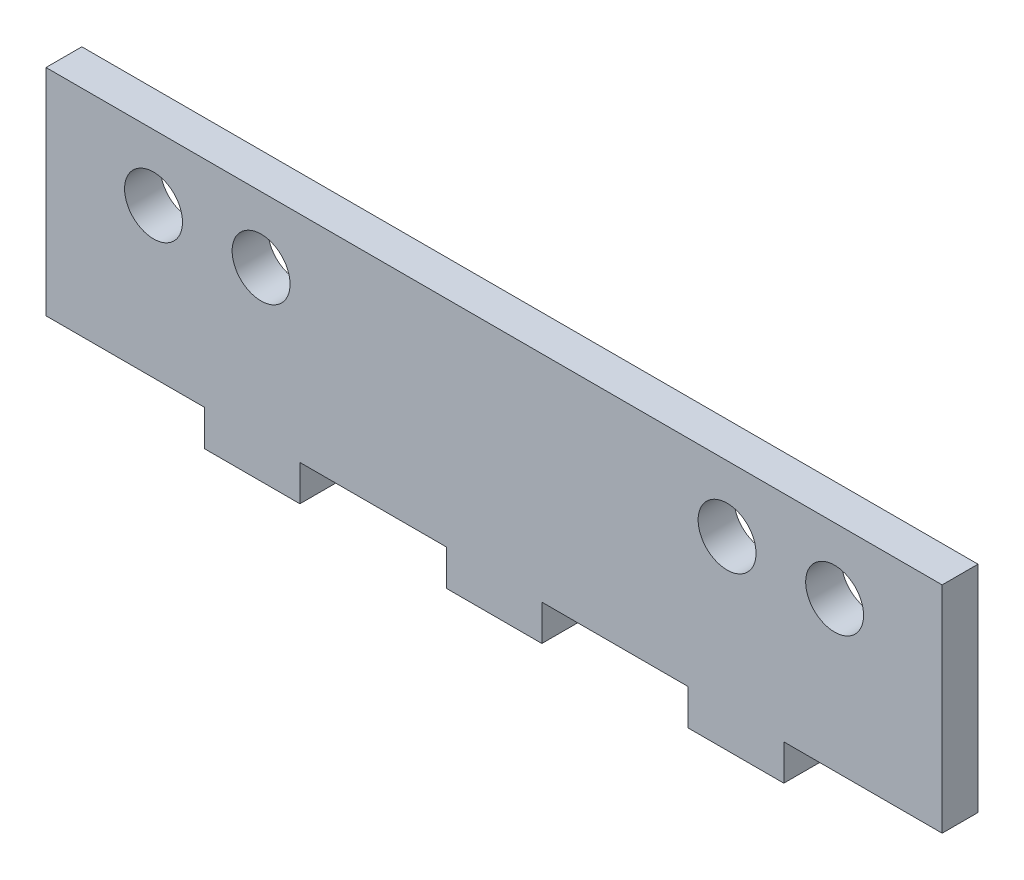
ISO-10303-21;
HEADER;
FILE_DESCRIPTION(('STEP AP214'),'2;1');
FILE_NAME('part.step','',(''),(''),'','','');
FILE_SCHEMA(('AUTOMOTIVE_DESIGN { 1 0 10303 214 1 1 1 1 }'));
ENDSEC;
DATA;
#1=APPLICATION_CONTEXT('core data for automotive mechanical design processes');
#2=APPLICATION_PROTOCOL_DEFINITION('international standard','automotive_design',2000,#1);
#3=PRODUCT_CONTEXT('',#1,'mechanical');
#4=PRODUCT('Part','Part','',(#3));
#5=PRODUCT_RELATED_PRODUCT_CATEGORY('part','',(#4));
#6=PRODUCT_DEFINITION_FORMATION('','',#4);
#7=PRODUCT_DEFINITION_CONTEXT('part definition',#1,'design');
#8=PRODUCT_DEFINITION('design','',#6,#7);
#9=PRODUCT_DEFINITION_SHAPE('','',#8);
#10=(LENGTH_UNIT() NAMED_UNIT(*) SI_UNIT(.MILLI.,.METRE.));
#11=(NAMED_UNIT(*) PLANE_ANGLE_UNIT() SI_UNIT($,.RADIAN.));
#12=(NAMED_UNIT(*) SI_UNIT($,.STERADIAN.) SOLID_ANGLE_UNIT());
#13=UNCERTAINTY_MEASURE_WITH_UNIT(LENGTH_MEASURE(1.E-05),#10,'distance_accuracy_value','');
#14=(GEOMETRIC_REPRESENTATION_CONTEXT(3) GLOBAL_UNCERTAINTY_ASSIGNED_CONTEXT((#13)) GLOBAL_UNIT_ASSIGNED_CONTEXT((#10,
#11,#12)) REPRESENTATION_CONTEXT('',''));
#15=CARTESIAN_POINT('',(0.,0.,0.));
#16=DIRECTION('',(0.,0.,1.));
#17=DIRECTION('',(1.,0.,0.));
#18=AXIS2_PLACEMENT_3D('',#15,#16,#17);
#19=CARTESIAN_POINT('',(37.5,-8.99999999999999,3.));
#20=DIRECTION('',(0.,1.,0.));
#21=DIRECTION('',(-1.,0.,0.));
#22=AXIS2_PLACEMENT_3D('',#19,#20,#21);
#23=PLANE('',#22);
#24=DIRECTION('',(0.,0.,1.));
#25=VECTOR('',#24,1.);
#26=CARTESIAN_POINT('',(-16.25,-9.,0.));
#27=LINE('',#26,#25);
#28=CARTESIAN_POINT('',(-16.25,-9.,0.));
#29=VERTEX_POINT('',#28);
#30=CARTESIAN_POINT('',(-16.25,-9.,3.));
#31=VERTEX_POINT('',#30);
#32=EDGE_CURVE('E169',#29,#31,#27,.T.);
#33=ORIENTED_EDGE('',*,*,#32,.F.);
#34=DIRECTION('',(1.,0.,0.));
#35=VECTOR('',#34,1.);
#36=CARTESIAN_POINT('',(37.5,-8.99999999999999,0.));
#37=LINE('',#36,#35);
#38=CARTESIAN_POINT('',(-3.99999999999999,-9.,0.));
#39=VERTEX_POINT('',#38);
#40=EDGE_CURVE('E247',#29,#39,#37,.T.);
#41=ORIENTED_EDGE('',*,*,#40,.T.);
#42=DIRECTION('',(0.,0.,-1.));
#43=VECTOR('',#42,1.);
#44=CARTESIAN_POINT('',(-3.99999999999999,-9.,0.));
#45=LINE('',#44,#43);
#46=CARTESIAN_POINT('',(-3.99999999999999,-9.,3.));
#47=VERTEX_POINT('',#46);
#48=EDGE_CURVE('E173',#47,#39,#45,.T.);
#49=ORIENTED_EDGE('',*,*,#48,.F.);
#50=DIRECTION('',(1.,0.,0.));
#51=VECTOR('',#50,1.);
#52=CARTESIAN_POINT('',(37.5,-8.99999999999999,3.));
#53=LINE('',#52,#51);
#54=EDGE_CURVE('E48',#31,#47,#53,.T.);
#55=ORIENTED_EDGE('',*,*,#54,.F.);
#56=EDGE_LOOP('',(#33,#41,#49,#55));
#57=FACE_BOUND('',#56,.T.);
#58=ADVANCED_FACE('F33',(#57),#23,.F.);
#59=DIRECTION('',(0.,0.,-1.));
#60=VECTOR('',#59,1.);
#61=CARTESIAN_POINT('',(-24.25,-9.,0.));
#62=LINE('',#61,#60);
#63=CARTESIAN_POINT('',(-24.25,-9.,3.));
#64=VERTEX_POINT('',#63);
#65=CARTESIAN_POINT('',(-24.25,-9.,0.));
#66=VERTEX_POINT('',#65);
#67=EDGE_CURVE('E56',#64,#66,#62,.T.);
#68=ORIENTED_EDGE('',*,*,#67,.F.);
#69=CARTESIAN_POINT('',(-37.5,-9.,3.));
#70=VERTEX_POINT('',#69);
#71=EDGE_CURVE('E234',#70,#64,#53,.T.);
#72=ORIENTED_EDGE('',*,*,#71,.F.);
#73=DIRECTION('',(0.,0.,-1.));
#74=VECTOR('',#73,1.);
#75=CARTESIAN_POINT('',(-37.5,-9.,3.));
#76=LINE('',#75,#74);
#77=CARTESIAN_POINT('',(-37.5,-9.,0.));
#78=VERTEX_POINT('',#77);
#79=EDGE_CURVE('E11',#70,#78,#76,.T.);
#80=ORIENTED_EDGE('',*,*,#79,.T.);
#81=EDGE_CURVE('E244',#78,#66,#37,.T.);
#82=ORIENTED_EDGE('',*,*,#81,.T.);
#83=EDGE_LOOP('',(#68,#72,#80,#82));
#84=FACE_BOUND('',#83,.T.);
#85=ADVANCED_FACE('F312',(#84),#23,.F.);
#86=DIRECTION('',(0.,0.,1.));
#87=VECTOR('',#86,1.);
#88=CARTESIAN_POINT('',(4.00000000000001,-9.,0.));
#89=LINE('',#88,#87);
#90=CARTESIAN_POINT('',(4.00000000000001,-9.,0.));
#91=VERTEX_POINT('',#90);
#92=CARTESIAN_POINT('',(4.00000000000002,-9.,3.));
#93=VERTEX_POINT('',#92);
#94=EDGE_CURVE('E170',#91,#93,#89,.T.);
#95=ORIENTED_EDGE('',*,*,#94,.F.);
#96=CARTESIAN_POINT('',(16.25,-8.99999999999999,0.));
#97=VERTEX_POINT('',#96);
#98=EDGE_CURVE('E295',#91,#97,#37,.T.);
#99=ORIENTED_EDGE('',*,*,#98,.T.);
#100=DIRECTION('',(0.,0.,-1.));
#101=VECTOR('',#100,1.);
#102=CARTESIAN_POINT('',(16.25,-8.99999999999999,0.));
#103=LINE('',#102,#101);
#104=CARTESIAN_POINT('',(16.25,-8.99999999999999,3.));
#105=VERTEX_POINT('',#104);
#106=EDGE_CURVE('E207',#105,#97,#103,.T.);
#107=ORIENTED_EDGE('',*,*,#106,.F.);
#108=EDGE_CURVE('E276',#93,#105,#53,.T.);
#109=ORIENTED_EDGE('',*,*,#108,.F.);
#110=EDGE_LOOP('',(#95,#99,#107,#109));
#111=FACE_BOUND('',#110,.T.);
#112=ADVANCED_FACE('F294',(#111),#23,.F.);
#113=DIRECTION('',(0.,0.,1.));
#114=VECTOR('',#113,1.);
#115=CARTESIAN_POINT('',(24.25,-8.99999999999999,0.));
#116=LINE('',#115,#114);
#117=CARTESIAN_POINT('',(24.25,-8.99999999999999,0.));
#118=VERTEX_POINT('',#117);
#119=CARTESIAN_POINT('',(24.25,-8.99999999999999,3.));
#120=VERTEX_POINT('',#119);
#121=EDGE_CURVE('E202',#118,#120,#116,.T.);
#122=ORIENTED_EDGE('',*,*,#121,.F.);
#123=CARTESIAN_POINT('',(37.5,-8.99999999999999,0.));
#124=VERTEX_POINT('',#123);
#125=EDGE_CURVE('E243',#118,#124,#37,.T.);
#126=ORIENTED_EDGE('',*,*,#125,.T.);
#127=DIRECTION('',(0.,0.,-1.));
#128=VECTOR('',#127,1.);
#129=CARTESIAN_POINT('',(37.5,-8.99999999999999,3.));
#130=LINE('',#129,#128);
#131=CARTESIAN_POINT('',(37.5,-8.99999999999999,3.));
#132=VERTEX_POINT('',#131);
#133=EDGE_CURVE('E41',#132,#124,#130,.T.);
#134=ORIENTED_EDGE('',*,*,#133,.F.);
#135=EDGE_CURVE('E232',#120,#132,#53,.T.);
#136=ORIENTED_EDGE('',*,*,#135,.F.);
#137=EDGE_LOOP('',(#122,#126,#134,#136));
#138=FACE_BOUND('',#137,.T.);
#139=ADVANCED_FACE('F306',(#138),#23,.F.);
#140=CARTESIAN_POINT('',(-37.5,9.,3.));
#141=DIRECTION('',(1.,0.,0.));
#142=DIRECTION('',(0.,0.,-1.));
#143=AXIS2_PLACEMENT_3D('',#140,#141,#142);
#144=PLANE('',#143);
#145=DIRECTION('',(0.,-1.,0.));
#146=VECTOR('',#145,1.);
#147=CARTESIAN_POINT('',(-37.5,9.,0.));
#148=LINE('',#147,#146);
#149=CARTESIAN_POINT('',(-37.5,9.,0.));
#150=VERTEX_POINT('',#149);
#151=EDGE_CURVE('E229',#150,#78,#148,.T.);
#152=ORIENTED_EDGE('',*,*,#151,.T.);
#153=ORIENTED_EDGE('',*,*,#79,.F.);
#154=DIRECTION('',(0.,-1.,0.));
#155=VECTOR('',#154,1.);
#156=CARTESIAN_POINT('',(-37.5,9.,3.));
#157=LINE('',#156,#155);
#158=CARTESIAN_POINT('',(-37.5,9.,3.));
#159=VERTEX_POINT('',#158);
#160=EDGE_CURVE('E230',#159,#70,#157,.T.);
#161=ORIENTED_EDGE('',*,*,#160,.F.);
#162=DIRECTION('',(0.,0.,-1.));
#163=VECTOR('',#162,1.);
#164=CARTESIAN_POINT('',(-37.5,9.,3.));
#165=LINE('',#164,#163);
#166=EDGE_CURVE('E240',#159,#150,#165,.T.);
#167=ORIENTED_EDGE('',*,*,#166,.T.);
#168=EDGE_LOOP('',(#152,#153,#161,#167));
#169=FACE_BOUND('',#168,.T.);
#170=ADVANCED_FACE('F35',(#169),#144,.F.);
#171=CARTESIAN_POINT('',(37.5,9.00000000000001,3.));
#172=DIRECTION('',(-1.,0.,0.));
#173=DIRECTION('',(0.,0.,1.));
#174=AXIS2_PLACEMENT_3D('',#171,#172,#173);
#175=PLANE('',#174);
#176=DIRECTION('',(0.,1.,0.));
#177=VECTOR('',#176,1.);
#178=CARTESIAN_POINT('',(37.5,9.00000000000001,0.));
#179=LINE('',#178,#177);
#180=CARTESIAN_POINT('',(37.5,9.00000000000001,0.));
#181=VERTEX_POINT('',#180);
#182=EDGE_CURVE('E246',#124,#181,#179,.T.);
#183=ORIENTED_EDGE('',*,*,#182,.T.);
#184=DIRECTION('',(0.,0.,-1.));
#185=VECTOR('',#184,1.);
#186=CARTESIAN_POINT('',(37.5,9.00000000000001,3.));
#187=LINE('',#186,#185);
#188=CARTESIAN_POINT('',(37.5,9.00000000000001,3.));
#189=VERTEX_POINT('',#188);
#190=EDGE_CURVE('E252',#189,#181,#187,.T.);
#191=ORIENTED_EDGE('',*,*,#190,.F.);
#192=DIRECTION('',(0.,1.,0.));
#193=VECTOR('',#192,1.);
#194=CARTESIAN_POINT('',(37.5,9.00000000000001,3.));
#195=LINE('',#194,#193);
#196=EDGE_CURVE('E236',#132,#189,#195,.T.);
#197=ORIENTED_EDGE('',*,*,#196,.F.);
#198=ORIENTED_EDGE('',*,*,#133,.T.);
#199=EDGE_LOOP('',(#183,#191,#197,#198));
#200=FACE_BOUND('',#199,.T.);
#201=ADVANCED_FACE('F259',(#200),#175,.F.);
#202=CARTESIAN_POINT('',(37.5,9.00000000000001,3.));
#203=DIRECTION('',(0.,-1.,0.));
#204=DIRECTION('',(1.,0.,0.));
#205=AXIS2_PLACEMENT_3D('',#202,#203,#204);
#206=PLANE('',#205);
#207=DIRECTION('',(-1.,0.,0.));
#208=VECTOR('',#207,1.);
#209=CARTESIAN_POINT('',(37.5,9.00000000000001,0.));
#210=LINE('',#209,#208);
#211=EDGE_CURVE('E233',#181,#150,#210,.T.);
#212=ORIENTED_EDGE('',*,*,#211,.T.);
#213=ORIENTED_EDGE('',*,*,#166,.F.);
#214=DIRECTION('',(-1.,0.,0.));
#215=VECTOR('',#214,1.);
#216=CARTESIAN_POINT('',(37.5,9.00000000000001,3.));
#217=LINE('',#216,#215);
#218=EDGE_CURVE('E238',#189,#159,#217,.T.);
#219=ORIENTED_EDGE('',*,*,#218,.F.);
#220=ORIENTED_EDGE('',*,*,#190,.T.);
#221=EDGE_LOOP('',(#212,#213,#219,#220));
#222=FACE_BOUND('',#221,.T.);
#223=ADVANCED_FACE('F270',(#222),#206,.F.);
#224=CARTESIAN_POINT('',(0.,0.,3.));
#225=DIRECTION('',(0.,0.,-1.));
#226=DIRECTION('',(-1.,0.,0.));
#227=AXIS2_PLACEMENT_3D('',#224,#225,#226);
#228=PLANE('',#227);
#229=CARTESIAN_POINT('',(28.5,3.50000000000001,3.));
#230=DIRECTION('',(0.,0.,-1.));
#231=DIRECTION('',(-1.,0.,0.));
#232=AXIS2_PLACEMENT_3D('',#229,#230,#231);
#233=CIRCLE('',#232,2.425);
#234=CARTESIAN_POINT('',(26.075,3.50000000000001,3.));
#235=VERTEX_POINT('',#234);
#236=EDGE_CURVE('E512',#235,#235,#233,.T.);
#237=ORIENTED_EDGE('',*,*,#236,.T.);
#238=EDGE_LOOP('',(#237));
#239=FACE_BOUND('',#238,.T.);
#240=CARTESIAN_POINT('',(-19.5,3.50000000000001,3.));
#241=DIRECTION('',(0.,0.,-1.));
#242=DIRECTION('',(-1.,0.,0.));
#243=AXIS2_PLACEMENT_3D('',#240,#241,#242);
#244=CIRCLE('',#243,2.425);
#245=CARTESIAN_POINT('',(-21.925,3.50000000000001,3.));
#246=VERTEX_POINT('',#245);
#247=EDGE_CURVE('E523',#246,#246,#244,.T.);
#248=ORIENTED_EDGE('',*,*,#247,.T.);
#249=EDGE_LOOP('',(#248));
#250=FACE_BOUND('',#249,.T.);
#251=CARTESIAN_POINT('',(19.5,3.50000000000001,3.));
#252=DIRECTION('',(0.,0.,-1.));
#253=DIRECTION('',(-1.,0.,0.));
#254=AXIS2_PLACEMENT_3D('',#251,#252,#253);
#255=CIRCLE('',#254,2.425);
#256=CARTESIAN_POINT('',(17.075,3.50000000000001,3.));
#257=VERTEX_POINT('',#256);
#258=EDGE_CURVE('E532',#257,#257,#255,.T.);
#259=ORIENTED_EDGE('',*,*,#258,.T.);
#260=EDGE_LOOP('',(#259));
#261=FACE_BOUND('',#260,.T.);
#262=CARTESIAN_POINT('',(-28.5,3.50000000000001,3.));
#263=DIRECTION('',(0.,0.,-1.));
#264=DIRECTION('',(-1.,0.,0.));
#265=AXIS2_PLACEMENT_3D('',#262,#263,#264);
#266=CIRCLE('',#265,2.425);
#267=CARTESIAN_POINT('',(-30.925,3.50000000000001,3.));
#268=VERTEX_POINT('',#267);
#269=EDGE_CURVE('E516',#268,#268,#266,.T.);
#270=ORIENTED_EDGE('',*,*,#269,.T.);
#271=EDGE_LOOP('',(#270));
#272=FACE_BOUND('',#271,.T.);
#273=ORIENTED_EDGE('',*,*,#160,.T.);
#274=ORIENTED_EDGE('',*,*,#71,.T.);
#275=DIRECTION('',(0.,1.,0.));
#276=VECTOR('',#275,1.);
#277=CARTESIAN_POINT('',(-24.25,-12.,3.));
#278=LINE('',#277,#276);
#279=CARTESIAN_POINT('',(-24.25,-12.,3.));
#280=VERTEX_POINT('',#279);
#281=EDGE_CURVE('E154',#280,#64,#278,.T.);
#282=ORIENTED_EDGE('',*,*,#281,.F.);
#283=DIRECTION('',(-1.,0.,0.));
#284=VECTOR('',#283,1.);
#285=CARTESIAN_POINT('',(-16.25,-12.,3.));
#286=LINE('',#285,#284);
#287=CARTESIAN_POINT('',(-16.25,-12.,3.));
#288=VERTEX_POINT('',#287);
#289=EDGE_CURVE('E146',#288,#280,#286,.T.);
#290=ORIENTED_EDGE('',*,*,#289,.F.);
#291=DIRECTION('',(0.,1.,0.));
#292=VECTOR('',#291,1.);
#293=CARTESIAN_POINT('',(-16.25,-12.,3.));
#294=LINE('',#293,#292);
#295=EDGE_CURVE('E151',#288,#31,#294,.T.);
#296=ORIENTED_EDGE('',*,*,#295,.T.);
#297=ORIENTED_EDGE('',*,*,#54,.T.);
#298=DIRECTION('',(0.,1.,0.));
#299=VECTOR('',#298,1.);
#300=CARTESIAN_POINT('',(-3.99999999999999,-12.,3.));
#301=LINE('',#300,#299);
#302=CARTESIAN_POINT('',(-3.99999999999999,-12.,3.));
#303=VERTEX_POINT('',#302);
#304=EDGE_CURVE('E196',#303,#47,#301,.T.);
#305=ORIENTED_EDGE('',*,*,#304,.F.);
#306=DIRECTION('',(-1.,0.,0.));
#307=VECTOR('',#306,1.);
#308=CARTESIAN_POINT('',(4.00000000000002,-12.,3.));
#309=LINE('',#308,#307);
#310=CARTESIAN_POINT('',(4.00000000000002,-12.,3.));
#311=VERTEX_POINT('',#310);
#312=EDGE_CURVE('E182',#311,#303,#309,.T.);
#313=ORIENTED_EDGE('',*,*,#312,.F.);
#314=DIRECTION('',(0.,1.,0.));
#315=VECTOR('',#314,1.);
#316=CARTESIAN_POINT('',(4.00000000000002,-12.,3.));
#317=LINE('',#316,#315);
#318=EDGE_CURVE('E199',#311,#93,#317,.T.);
#319=ORIENTED_EDGE('',*,*,#318,.T.);
#320=ORIENTED_EDGE('',*,*,#108,.T.);
#321=DIRECTION('',(0.,1.,0.));
#322=VECTOR('',#321,1.);
#323=CARTESIAN_POINT('',(16.25,-12.,3.));
#324=LINE('',#323,#322);
#325=CARTESIAN_POINT('',(16.25,-12.,3.));
#326=VERTEX_POINT('',#325);
#327=EDGE_CURVE('E223',#326,#105,#324,.T.);
#328=ORIENTED_EDGE('',*,*,#327,.F.);
#329=DIRECTION('',(-1.,0.,0.));
#330=VECTOR('',#329,1.);
#331=CARTESIAN_POINT('',(24.25,-12.,3.));
#332=LINE('',#331,#330);
#333=CARTESIAN_POINT('',(24.25,-12.,3.));
#334=VERTEX_POINT('',#333);
#335=EDGE_CURVE('E206',#334,#326,#332,.T.);
#336=ORIENTED_EDGE('',*,*,#335,.F.);
#337=DIRECTION('',(0.,1.,0.));
#338=VECTOR('',#337,1.);
#339=CARTESIAN_POINT('',(24.25,-12.,3.));
#340=LINE('',#339,#338);
#341=EDGE_CURVE('E226',#334,#120,#340,.T.);
#342=ORIENTED_EDGE('',*,*,#341,.T.);
#343=ORIENTED_EDGE('',*,*,#135,.T.);
#344=ORIENTED_EDGE('',*,*,#196,.T.);
#345=ORIENTED_EDGE('',*,*,#218,.T.);
#346=EDGE_LOOP('',(#273,#274,#282,#290,#296,#297,#305,#313,#319,#320,#328,#336,#342,#343,#344,#345));
#347=FACE_BOUND('',#346,.T.);
#348=ADVANCED_FACE('F149',(#239,#250,#261,#272,#347),#228,.F.);
#349=CARTESIAN_POINT('',(0.,0.,0.));
#350=DIRECTION('',(0.,0.,-1.));
#351=DIRECTION('',(-1.,0.,0.));
#352=AXIS2_PLACEMENT_3D('',#349,#350,#351);
#353=PLANE('',#352);
#354=CARTESIAN_POINT('',(28.5,3.50000000000001,0.));
#355=DIRECTION('',(0.,0.,-1.));
#356=DIRECTION('',(-1.,0.,0.));
#357=AXIS2_PLACEMENT_3D('',#354,#355,#356);
#358=CIRCLE('',#357,2.425);
#359=CARTESIAN_POINT('',(26.075,3.50000000000001,0.));
#360=VERTEX_POINT('',#359);
#361=EDGE_CURVE('E515',#360,#360,#358,.T.);
#362=ORIENTED_EDGE('',*,*,#361,.F.);
#363=EDGE_LOOP('',(#362));
#364=FACE_BOUND('',#363,.T.);
#365=CARTESIAN_POINT('',(-19.5,3.50000000000001,0.));
#366=DIRECTION('',(0.,0.,-1.));
#367=DIRECTION('',(-1.,0.,0.));
#368=AXIS2_PLACEMENT_3D('',#365,#366,#367);
#369=CIRCLE('',#368,2.425);
#370=CARTESIAN_POINT('',(-21.925,3.50000000000001,0.));
#371=VERTEX_POINT('',#370);
#372=EDGE_CURVE('E527',#371,#371,#369,.T.);
#373=ORIENTED_EDGE('',*,*,#372,.F.);
#374=EDGE_LOOP('',(#373));
#375=FACE_BOUND('',#374,.T.);
#376=CARTESIAN_POINT('',(19.5,3.50000000000001,0.));
#377=DIRECTION('',(0.,0.,-1.));
#378=DIRECTION('',(-1.,0.,0.));
#379=AXIS2_PLACEMENT_3D('',#376,#377,#378);
#380=CIRCLE('',#379,2.425);
#381=CARTESIAN_POINT('',(17.075,3.50000000000001,0.));
#382=VERTEX_POINT('',#381);
#383=EDGE_CURVE('E526',#382,#382,#380,.T.);
#384=ORIENTED_EDGE('',*,*,#383,.F.);
#385=EDGE_LOOP('',(#384));
#386=FACE_BOUND('',#385,.T.);
#387=CARTESIAN_POINT('',(-28.5,3.50000000000001,0.));
#388=DIRECTION('',(0.,0.,-1.));
#389=DIRECTION('',(-1.,0.,0.));
#390=AXIS2_PLACEMENT_3D('',#387,#388,#389);
#391=CIRCLE('',#390,2.425);
#392=CARTESIAN_POINT('',(-30.925,3.50000000000001,0.));
#393=VERTEX_POINT('',#392);
#394=EDGE_CURVE('E520',#393,#393,#391,.T.);
#395=ORIENTED_EDGE('',*,*,#394,.F.);
#396=EDGE_LOOP('',(#395));
#397=FACE_BOUND('',#396,.T.);
#398=ORIENTED_EDGE('',*,*,#151,.F.);
#399=ORIENTED_EDGE('',*,*,#211,.F.);
#400=ORIENTED_EDGE('',*,*,#182,.F.);
#401=ORIENTED_EDGE('',*,*,#125,.F.);
#402=DIRECTION('',(0.,1.,0.));
#403=VECTOR('',#402,1.);
#404=CARTESIAN_POINT('',(24.25,-12.,0.));
#405=LINE('',#404,#403);
#406=CARTESIAN_POINT('',(24.25,-12.,0.));
#407=VERTEX_POINT('',#406);
#408=EDGE_CURVE('E213',#407,#118,#405,.T.);
#409=ORIENTED_EDGE('',*,*,#408,.F.);
#410=DIRECTION('',(1.,0.,0.));
#411=VECTOR('',#410,1.);
#412=CARTESIAN_POINT('',(24.25,-12.,0.));
#413=LINE('',#412,#411);
#414=CARTESIAN_POINT('',(16.25,-12.,0.));
#415=VERTEX_POINT('',#414);
#416=EDGE_CURVE('E211',#415,#407,#413,.T.);
#417=ORIENTED_EDGE('',*,*,#416,.F.);
#418=DIRECTION('',(0.,1.,0.));
#419=VECTOR('',#418,1.);
#420=CARTESIAN_POINT('',(16.25,-12.,0.));
#421=LINE('',#420,#419);
#422=EDGE_CURVE('E220',#415,#97,#421,.T.);
#423=ORIENTED_EDGE('',*,*,#422,.T.);
#424=ORIENTED_EDGE('',*,*,#98,.F.);
#425=DIRECTION('',(0.,1.,0.));
#426=VECTOR('',#425,1.);
#427=CARTESIAN_POINT('',(4.00000000000001,-12.,0.));
#428=LINE('',#427,#426);
#429=CARTESIAN_POINT('',(4.00000000000001,-12.,0.));
#430=VERTEX_POINT('',#429);
#431=EDGE_CURVE('E187',#430,#91,#428,.T.);
#432=ORIENTED_EDGE('',*,*,#431,.F.);
#433=DIRECTION('',(1.,0.,0.));
#434=VECTOR('',#433,1.);
#435=CARTESIAN_POINT('',(4.00000000000001,-12.,0.));
#436=LINE('',#435,#434);
#437=CARTESIAN_POINT('',(-3.99999999999999,-12.,0.));
#438=VERTEX_POINT('',#437);
#439=EDGE_CURVE('E186',#438,#430,#436,.T.);
#440=ORIENTED_EDGE('',*,*,#439,.F.);
#441=DIRECTION('',(0.,1.,0.));
#442=VECTOR('',#441,1.);
#443=CARTESIAN_POINT('',(-3.99999999999999,-12.,0.));
#444=LINE('',#443,#442);
#445=EDGE_CURVE('E193',#438,#39,#444,.T.);
#446=ORIENTED_EDGE('',*,*,#445,.T.);
#447=ORIENTED_EDGE('',*,*,#40,.F.);
#448=DIRECTION('',(0.,1.,0.));
#449=VECTOR('',#448,1.);
#450=CARTESIAN_POINT('',(-16.25,-12.,0.));
#451=LINE('',#450,#449);
#452=CARTESIAN_POINT('',(-16.25,-12.,0.));
#453=VERTEX_POINT('',#452);
#454=EDGE_CURVE('E539',#453,#29,#451,.T.);
#455=ORIENTED_EDGE('',*,*,#454,.F.);
#456=DIRECTION('',(1.,0.,0.));
#457=VECTOR('',#456,1.);
#458=CARTESIAN_POINT('',(-16.25,-12.,0.));
#459=LINE('',#458,#457);
#460=CARTESIAN_POINT('',(-24.25,-12.,0.));
#461=VERTEX_POINT('',#460);
#462=EDGE_CURVE('E163',#461,#453,#459,.T.);
#463=ORIENTED_EDGE('',*,*,#462,.F.);
#464=DIRECTION('',(0.,1.,0.));
#465=VECTOR('',#464,1.);
#466=CARTESIAN_POINT('',(-24.25,-12.,0.));
#467=LINE('',#466,#465);
#468=EDGE_CURVE('E175',#461,#66,#467,.T.);
#469=ORIENTED_EDGE('',*,*,#468,.T.);
#470=ORIENTED_EDGE('',*,*,#81,.F.);
#471=EDGE_LOOP('',(#398,#399,#400,#401,#409,#417,#423,#424,#432,#440,#446,#447,#455,#463,#469,#470));
#472=FACE_BOUND('',#471,.T.);
#473=ADVANCED_FACE('F266',(#364,#375,#386,#397,#472),#353,.T.);
#474=CARTESIAN_POINT('',(24.25,-12.,0.));
#475=DIRECTION('',(-1.,0.,0.));
#476=DIRECTION('',(0.,-1.,0.));
#477=AXIS2_PLACEMENT_3D('',#474,#475,#476);
#478=PLANE('',#477);
#479=ORIENTED_EDGE('',*,*,#121,.T.);
#480=ORIENTED_EDGE('',*,*,#341,.F.);
#481=DIRECTION('',(0.,0.,1.));
#482=VECTOR('',#481,1.);
#483=CARTESIAN_POINT('',(24.25,-12.,0.));
#484=LINE('',#483,#482);
#485=EDGE_CURVE('E203',#407,#334,#484,.T.);
#486=ORIENTED_EDGE('',*,*,#485,.F.);
#487=ORIENTED_EDGE('',*,*,#408,.T.);
#488=EDGE_LOOP('',(#479,#480,#486,#487));
#489=FACE_BOUND('',#488,.T.);
#490=ADVANCED_FACE('F305',(#489),#478,.F.);
#491=CARTESIAN_POINT('',(16.25,-12.,0.));
#492=DIRECTION('',(1.,0.,0.));
#493=DIRECTION('',(0.,1.,0.));
#494=AXIS2_PLACEMENT_3D('',#491,#492,#493);
#495=PLANE('',#494);
#496=ORIENTED_EDGE('',*,*,#106,.T.);
#497=ORIENTED_EDGE('',*,*,#422,.F.);
#498=DIRECTION('',(0.,0.,-1.));
#499=VECTOR('',#498,1.);
#500=CARTESIAN_POINT('',(16.25,-12.,0.));
#501=LINE('',#500,#499);
#502=EDGE_CURVE('E209',#326,#415,#501,.T.);
#503=ORIENTED_EDGE('',*,*,#502,.F.);
#504=ORIENTED_EDGE('',*,*,#327,.T.);
#505=EDGE_LOOP('',(#496,#497,#503,#504));
#506=FACE_BOUND('',#505,.T.);
#507=ADVANCED_FACE('F299',(#506),#495,.F.);
#508=CARTESIAN_POINT('',(0.,-12.,0.));
#509=DIRECTION('',(0.,-1.,0.));
#510=DIRECTION('',(0.,0.,-1.));
#511=AXIS2_PLACEMENT_3D('',#508,#509,#510);
#512=PLANE('',#511);
#513=ORIENTED_EDGE('',*,*,#485,.T.);
#514=ORIENTED_EDGE('',*,*,#335,.T.);
#515=ORIENTED_EDGE('',*,*,#502,.T.);
#516=ORIENTED_EDGE('',*,*,#416,.T.);
#517=EDGE_LOOP('',(#513,#514,#515,#516));
#518=FACE_BOUND('',#517,.T.);
#519=ADVANCED_FACE('F302',(#518),#512,.T.);
#520=CARTESIAN_POINT('',(4.00000000000001,-12.,0.));
#521=DIRECTION('',(-1.,0.,0.));
#522=DIRECTION('',(0.,0.,1.));
#523=AXIS2_PLACEMENT_3D('',#520,#521,#522);
#524=PLANE('',#523);
#525=ORIENTED_EDGE('',*,*,#94,.T.);
#526=ORIENTED_EDGE('',*,*,#318,.F.);
#527=DIRECTION('',(0.,0.,1.));
#528=VECTOR('',#527,1.);
#529=CARTESIAN_POINT('',(4.00000000000001,-12.,0.));
#530=LINE('',#529,#528);
#531=EDGE_CURVE('E179',#430,#311,#530,.T.);
#532=ORIENTED_EDGE('',*,*,#531,.F.);
#533=ORIENTED_EDGE('',*,*,#431,.T.);
#534=EDGE_LOOP('',(#525,#526,#532,#533));
#535=FACE_BOUND('',#534,.T.);
#536=ADVANCED_FACE('F292',(#535),#524,.F.);
#537=CARTESIAN_POINT('',(-3.99999999999999,-12.,0.));
#538=DIRECTION('',(1.,0.,0.));
#539=DIRECTION('',(0.,1.,0.));
#540=AXIS2_PLACEMENT_3D('',#537,#538,#539);
#541=PLANE('',#540);
#542=ORIENTED_EDGE('',*,*,#48,.T.);
#543=ORIENTED_EDGE('',*,*,#445,.F.);
#544=DIRECTION('',(0.,0.,-1.));
#545=VECTOR('',#544,1.);
#546=CARTESIAN_POINT('',(-3.99999999999999,-12.,0.));
#547=LINE('',#546,#545);
#548=EDGE_CURVE('E184',#303,#438,#547,.T.);
#549=ORIENTED_EDGE('',*,*,#548,.F.);
#550=ORIENTED_EDGE('',*,*,#304,.T.);
#551=EDGE_LOOP('',(#542,#543,#549,#550));
#552=FACE_BOUND('',#551,.T.);
#553=ADVANCED_FACE('F283',(#552),#541,.F.);
#554=CARTESIAN_POINT('',(0.,-12.,0.));
#555=DIRECTION('',(0.,-1.,0.));
#556=DIRECTION('',(0.,0.,-1.));
#557=AXIS2_PLACEMENT_3D('',#554,#555,#556);
#558=PLANE('',#557);
#559=ORIENTED_EDGE('',*,*,#531,.T.);
#560=ORIENTED_EDGE('',*,*,#312,.T.);
#561=ORIENTED_EDGE('',*,*,#548,.T.);
#562=ORIENTED_EDGE('',*,*,#439,.T.);
#563=EDGE_LOOP('',(#559,#560,#561,#562));
#564=FACE_BOUND('',#563,.T.);
#565=ADVANCED_FACE('F286',(#564),#558,.T.);
#566=CARTESIAN_POINT('',(-16.25,-12.,0.));
#567=DIRECTION('',(-1.,0.,0.));
#568=DIRECTION('',(0.,-1.,0.));
#569=AXIS2_PLACEMENT_3D('',#566,#567,#568);
#570=PLANE('',#569);
#571=ORIENTED_EDGE('',*,*,#32,.T.);
#572=ORIENTED_EDGE('',*,*,#295,.F.);
#573=DIRECTION('',(0.,0.,1.));
#574=VECTOR('',#573,1.);
#575=CARTESIAN_POINT('',(-16.25,-12.,0.));
#576=LINE('',#575,#574);
#577=EDGE_CURVE('E158',#453,#288,#576,.T.);
#578=ORIENTED_EDGE('',*,*,#577,.F.);
#579=ORIENTED_EDGE('',*,*,#454,.T.);
#580=EDGE_LOOP('',(#571,#572,#578,#579));
#581=FACE_BOUND('',#580,.T.);
#582=ADVANCED_FACE('F168',(#581),#570,.F.);
#583=CARTESIAN_POINT('',(-24.25,-12.,0.));
#584=DIRECTION('',(1.,0.,0.));
#585=DIRECTION('',(0.,1.,0.));
#586=AXIS2_PLACEMENT_3D('',#583,#584,#585);
#587=PLANE('',#586);
#588=ORIENTED_EDGE('',*,*,#67,.T.);
#589=ORIENTED_EDGE('',*,*,#468,.F.);
#590=DIRECTION('',(0.,0.,-1.));
#591=VECTOR('',#590,1.);
#592=CARTESIAN_POINT('',(-24.25,-12.,0.));
#593=LINE('',#592,#591);
#594=EDGE_CURVE('E157',#280,#461,#593,.T.);
#595=ORIENTED_EDGE('',*,*,#594,.F.);
#596=ORIENTED_EDGE('',*,*,#281,.T.);
#597=EDGE_LOOP('',(#588,#589,#595,#596));
#598=FACE_BOUND('',#597,.T.);
#599=ADVANCED_FACE('F388',(#598),#587,.F.);
#600=CARTESIAN_POINT('',(0.,-12.,0.));
#601=DIRECTION('',(0.,-1.,0.));
#602=DIRECTION('',(0.,0.,-1.));
#603=AXIS2_PLACEMENT_3D('',#600,#601,#602);
#604=PLANE('',#603);
#605=ORIENTED_EDGE('',*,*,#577,.T.);
#606=ORIENTED_EDGE('',*,*,#289,.T.);
#607=ORIENTED_EDGE('',*,*,#594,.T.);
#608=ORIENTED_EDGE('',*,*,#462,.T.);
#609=EDGE_LOOP('',(#605,#606,#607,#608));
#610=FACE_BOUND('',#609,.T.);
#611=ADVANCED_FACE('F161',(#610),#604,.T.);
#612=CARTESIAN_POINT('',(-28.5,3.50000000000001,3.));
#613=DIRECTION('',(0.,0.,-1.));
#614=DIRECTION('',(-1.,0.,0.));
#615=AXIS2_PLACEMENT_3D('',#612,#613,#614);
#616=CYLINDRICAL_SURFACE('',#615,2.425);
#617=ORIENTED_EDGE('',*,*,#269,.F.);
#618=EDGE_LOOP('',(#617));
#619=FACE_BOUND('',#618,.T.);
#620=ORIENTED_EDGE('',*,*,#394,.T.);
#621=EDGE_LOOP('',(#620));
#622=FACE_BOUND('',#621,.T.);
#623=ADVANCED_FACE('F406',(#619,#622),#616,.F.);
#624=CARTESIAN_POINT('',(19.5,3.50000000000001,3.));
#625=DIRECTION('',(0.,0.,-1.));
#626=DIRECTION('',(-1.,0.,0.));
#627=AXIS2_PLACEMENT_3D('',#624,#625,#626);
#628=CYLINDRICAL_SURFACE('',#627,2.425);
#629=ORIENTED_EDGE('',*,*,#258,.F.);
#630=EDGE_LOOP('',(#629));
#631=FACE_BOUND('',#630,.T.);
#632=ORIENTED_EDGE('',*,*,#383,.T.);
#633=EDGE_LOOP('',(#632));
#634=FACE_BOUND('',#633,.T.);
#635=ADVANCED_FACE('F435',(#631,#634),#628,.F.);
#636=CARTESIAN_POINT('',(-19.5,3.50000000000001,3.));
#637=DIRECTION('',(0.,0.,-1.));
#638=DIRECTION('',(-1.,0.,0.));
#639=AXIS2_PLACEMENT_3D('',#636,#637,#638);
#640=CYLINDRICAL_SURFACE('',#639,2.425);
#641=ORIENTED_EDGE('',*,*,#247,.F.);
#642=EDGE_LOOP('',(#641));
#643=FACE_BOUND('',#642,.T.);
#644=ORIENTED_EDGE('',*,*,#372,.T.);
#645=EDGE_LOOP('',(#644));
#646=FACE_BOUND('',#645,.T.);
#647=ADVANCED_FACE('F445',(#643,#646),#640,.F.);
#648=CARTESIAN_POINT('',(28.5,3.50000000000001,3.));
#649=DIRECTION('',(0.,0.,-1.));
#650=DIRECTION('',(-1.,0.,0.));
#651=AXIS2_PLACEMENT_3D('',#648,#649,#650);
#652=CYLINDRICAL_SURFACE('',#651,2.425);
#653=ORIENTED_EDGE('',*,*,#236,.F.);
#654=EDGE_LOOP('',(#653));
#655=FACE_BOUND('',#654,.T.);
#656=ORIENTED_EDGE('',*,*,#361,.T.);
#657=EDGE_LOOP('',(#656));
#658=FACE_BOUND('',#657,.T.);
#659=ADVANCED_FACE('F455',(#655,#658),#652,.F.);
#660=CLOSED_SHELL('',(#58,#85,#112,#139,#170,#201,#223,#348,#473,#490,#507,#519,#536,#553,#565,
#582,#599,#611,#623,#635,#647,#659));
#661=MANIFOLD_SOLID_BREP('B2',#660);
#662=ADVANCED_BREP_SHAPE_REPRESENTATION('',(#18,#661),#14);
#663=SHAPE_DEFINITION_REPRESENTATION(#9,#662);
ENDSEC;
END-ISO-10303-21;
